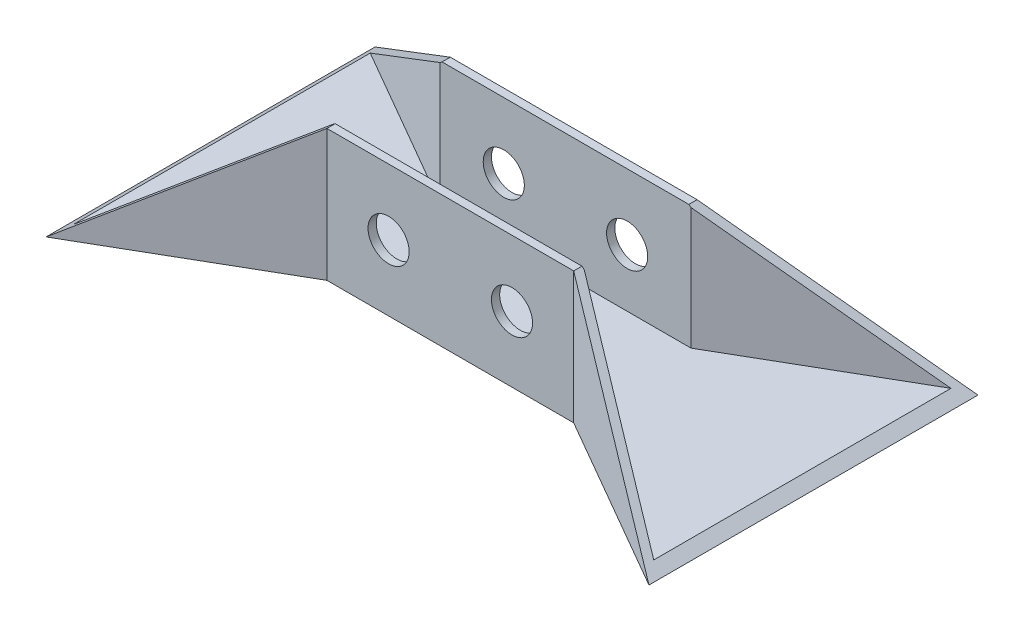
ISO-10303-21;
HEADER;
FILE_DESCRIPTION(('STEP AP214'),'2;1');
FILE_NAME('part.step','',(''),(''),'','','');
FILE_SCHEMA(('AUTOMOTIVE_DESIGN { 1 0 10303 214 1 1 1 1 }'));
ENDSEC;
DATA;
#1=APPLICATION_CONTEXT('core data for automotive mechanical design processes');
#2=APPLICATION_PROTOCOL_DEFINITION('international standard','automotive_design',2000,#1);
#3=PRODUCT_CONTEXT('',#1,'mechanical');
#4=PRODUCT('Part','Part','',(#3));
#5=PRODUCT_RELATED_PRODUCT_CATEGORY('part','',(#4));
#6=PRODUCT_DEFINITION_FORMATION('','',#4);
#7=PRODUCT_DEFINITION_CONTEXT('part definition',#1,'design');
#8=PRODUCT_DEFINITION('design','',#6,#7);
#9=PRODUCT_DEFINITION_SHAPE('','',#8);
#10=(LENGTH_UNIT() NAMED_UNIT(*) SI_UNIT(.MILLI.,.METRE.));
#11=(NAMED_UNIT(*) PLANE_ANGLE_UNIT() SI_UNIT($,.RADIAN.));
#12=(NAMED_UNIT(*) SI_UNIT($,.STERADIAN.) SOLID_ANGLE_UNIT());
#13=UNCERTAINTY_MEASURE_WITH_UNIT(LENGTH_MEASURE(1.E-05),#10,'distance_accuracy_value','');
#14=(GEOMETRIC_REPRESENTATION_CONTEXT(3) GLOBAL_UNCERTAINTY_ASSIGNED_CONTEXT((#13)) GLOBAL_UNIT_ASSIGNED_CONTEXT((#10,
#11,#12)) REPRESENTATION_CONTEXT('',''));
#15=CARTESIAN_POINT('',(0.,0.,0.));
#16=DIRECTION('',(0.,0.,1.));
#17=DIRECTION('',(1.,0.,0.));
#18=AXIS2_PLACEMENT_3D('',#15,#16,#17);
#19=CARTESIAN_POINT('',(0.,5.,0.));
#20=DIRECTION('',(0.,1.,0.));
#21=DIRECTION('',(0.,0.,1.));
#22=AXIS2_PLACEMENT_3D('',#19,#20,#21);
#23=PLANE('',#22);
#24=DIRECTION('',(0.,0.,1.));
#25=VECTOR('',#24,1.);
#26=CARTESIAN_POINT('',(176.487352005989,5.,0.));
#27=LINE('',#26,#25);
#28=CARTESIAN_POINT('',(176.487352005989,5.,-90.3202473081037));
#29=VERTEX_POINT('',#28);
#30=CARTESIAN_POINT('',(176.487352005989,5.,90.3202473081037));
#31=VERTEX_POINT('',#30);
#32=EDGE_CURVE('E221',#29,#31,#27,.T.);
#33=ORIENTED_EDGE('',*,*,#32,.F.);
#34=DIRECTION('',(0.866025403784438,0.,-0.500000000000001));
#35=VECTOR('',#34,1.);
#36=CARTESIAN_POINT('',(76.3397459621556,5.,-32.5));
#37=LINE('',#36,#35);
#38=CARTESIAN_POINT('',(76.3397459621556,5.,-32.5));
#39=VERTEX_POINT('',#38);
#40=EDGE_CURVE('E253',#39,#29,#37,.T.);
#41=ORIENTED_EDGE('',*,*,#40,.F.);
#42=DIRECTION('',(1.,0.,0.));
#43=VECTOR('',#42,1.);
#44=CARTESIAN_POINT('',(-76.3397459621556,5.,-32.5));
#45=LINE('',#44,#43);
#46=CARTESIAN_POINT('',(-76.3397459621556,5.,-32.5));
#47=VERTEX_POINT('',#46);
#48=EDGE_CURVE('E258',#47,#39,#45,.T.);
#49=ORIENTED_EDGE('',*,*,#48,.F.);
#50=DIRECTION('',(0.866025403784438,0.,0.500000000000001));
#51=VECTOR('',#50,1.);
#52=CARTESIAN_POINT('',(-183.253175473055,5.,-94.2264973081037));
#53=LINE('',#52,#51);
#54=CARTESIAN_POINT('',(-176.487352005989,5.,-90.3202473081037));
#55=VERTEX_POINT('',#54);
#56=EDGE_CURVE('E60',#55,#47,#53,.T.);
#57=ORIENTED_EDGE('',*,*,#56,.F.);
#58=DIRECTION('',(0.,0.,-1.));
#59=VECTOR('',#58,1.);
#60=CARTESIAN_POINT('',(-176.487352005989,5.,0.));
#61=LINE('',#60,#59);
#62=CARTESIAN_POINT('',(-176.487352005989,5.,90.3202473081038));
#63=VERTEX_POINT('',#62);
#64=EDGE_CURVE('E235',#63,#55,#61,.T.);
#65=ORIENTED_EDGE('',*,*,#64,.F.);
#66=DIRECTION('',(-0.866025403784438,0.,0.500000000000001));
#67=VECTOR('',#66,1.);
#68=CARTESIAN_POINT('',(-183.253175473055,5.,94.2264973081038));
#69=LINE('',#68,#67);
#70=CARTESIAN_POINT('',(-76.3397459621556,5.,32.5));
#71=VERTEX_POINT('',#70);
#72=EDGE_CURVE('E183',#71,#63,#69,.T.);
#73=ORIENTED_EDGE('',*,*,#72,.F.);
#74=DIRECTION('',(-1.,0.,0.));
#75=VECTOR('',#74,1.);
#76=CARTESIAN_POINT('',(-76.3397459621556,5.,32.5));
#77=LINE('',#76,#75);
#78=CARTESIAN_POINT('',(76.3397459621556,5.,32.5));
#79=VERTEX_POINT('',#78);
#80=EDGE_CURVE('E188',#79,#71,#77,.T.);
#81=ORIENTED_EDGE('',*,*,#80,.F.);
#82=DIRECTION('',(-0.866025403784438,0.,-0.500000000000001));
#83=VECTOR('',#82,1.);
#84=CARTESIAN_POINT('',(76.3397459621556,5.,32.5));
#85=LINE('',#84,#83);
#86=EDGE_CURVE('E187',#31,#79,#85,.T.);
#87=ORIENTED_EDGE('',*,*,#86,.F.);
#88=EDGE_LOOP('',(#33,#41,#49,#57,#65,#73,#81,#87));
#89=FACE_BOUND('',#88,.T.);
#90=ADVANCED_FACE('F35',(#89),#23,.T.);
#91=CARTESIAN_POINT('',(-75.,5.,-37.5));
#92=DIRECTION('',(-0.500000000000001,0.,0.866025403784438));
#93=DIRECTION('',(0.866025403784438,0.,0.500000000000001));
#94=AXIS2_PLACEMENT_3D('',#91,#92,#93);
#95=PLANE('',#94);
#96=DIRECTION('',(-0.866025403784438,0.,-0.500000000000001));
#97=VECTOR('',#96,1.);
#98=CARTESIAN_POINT('',(-75.,0.,-37.5));
#99=LINE('',#98,#97);
#100=CARTESIAN_POINT('',(-75.,0.,-37.5));
#101=VERTEX_POINT('',#100);
#102=CARTESIAN_POINT('',(-183.253175473055,0.,-100.));
#103=VERTEX_POINT('',#102);
#104=EDGE_CURVE('E278',#101,#103,#99,.T.);
#105=ORIENTED_EDGE('',*,*,#104,.T.);
#106=DIRECTION('',(0.729428429853969,0.539053696423368,0.421135700330756));
#107=VECTOR('',#106,1.);
#108=CARTESIAN_POINT('',(-104.490081854181,58.2065834279228,-54.5261066969353));
#109=LINE('',#108,#107);
#110=CARTESIAN_POINT('',(-75.,80.,-37.5));
#111=VERTEX_POINT('',#110);
#112=EDGE_CURVE('E246',#103,#111,#109,.T.);
#113=ORIENTED_EDGE('',*,*,#112,.T.);
#114=DIRECTION('',(0.,-1.,0.));
#115=VECTOR('',#114,1.);
#116=CARTESIAN_POINT('',(-75.,5.,-37.5));
#117=LINE('',#116,#115);
#118=EDGE_CURVE('E171',#111,#101,#117,.T.);
#119=ORIENTED_EDGE('',*,*,#118,.T.);
#120=EDGE_LOOP('',(#105,#113,#119));
#121=FACE_BOUND('',#120,.T.);
#122=ADVANCED_FACE('F37',(#121),#95,.F.);
#123=CARTESIAN_POINT('',(-183.253175473055,5.,100.));
#124=DIRECTION('',(-0.500000000000001,0.,-0.866025403784438));
#125=DIRECTION('',(-0.866025403784438,0.,0.500000000000001));
#126=AXIS2_PLACEMENT_3D('',#123,#124,#125);
#127=PLANE('',#126);
#128=DIRECTION('',(0.,-1.,0.));
#129=VECTOR('',#128,1.);
#130=CARTESIAN_POINT('',(-75.,5.,37.5));
#131=LINE('',#130,#129);
#132=CARTESIAN_POINT('',(-75.,80.,37.5));
#133=VERTEX_POINT('',#132);
#134=CARTESIAN_POINT('',(-75.,0.,37.5));
#135=VERTEX_POINT('',#134);
#136=EDGE_CURVE('E178',#133,#135,#131,.T.);
#137=ORIENTED_EDGE('',*,*,#136,.F.);
#138=DIRECTION('',(-0.729428429853969,-0.539053696423368,0.421135700330756));
#139=VECTOR('',#138,1.);
#140=CARTESIAN_POINT('',(-181.287170016109,1.45289443813848,98.8649262202043));
#141=LINE('',#140,#139);
#142=CARTESIAN_POINT('',(-183.253175473055,0.,100.));
#143=VERTEX_POINT('',#142);
#144=EDGE_CURVE('E243',#133,#143,#141,.T.);
#145=ORIENTED_EDGE('',*,*,#144,.T.);
#146=DIRECTION('',(0.866025403784438,0.,-0.500000000000001));
#147=VECTOR('',#146,1.);
#148=CARTESIAN_POINT('',(-183.253175473055,0.,100.));
#149=LINE('',#148,#147);
#150=EDGE_CURVE('E283',#143,#135,#149,.T.);
#151=ORIENTED_EDGE('',*,*,#150,.T.);
#152=EDGE_LOOP('',(#137,#145,#151));
#153=FACE_BOUND('',#152,.T.);
#154=ADVANCED_FACE('F291',(#153),#127,.F.);
#155=CARTESIAN_POINT('',(-75.,5.,37.5));
#156=DIRECTION('',(0.,0.,-1.));
#157=DIRECTION('',(-1.,0.,0.));
#158=AXIS2_PLACEMENT_3D('',#155,#156,#157);
#159=PLANE('',#158);
#160=CARTESIAN_POINT('',(37.5,40.,37.5));
#161=DIRECTION('',(0.,0.,-1.));
#162=DIRECTION('',(-1.,0.,0.));
#163=AXIS2_PLACEMENT_3D('',#160,#161,#162);
#164=CIRCLE('',#163,12.5);
#165=CARTESIAN_POINT('',(25.,40.,37.5));
#166=VERTEX_POINT('',#165);
#167=EDGE_CURVE('E193',#166,#166,#164,.T.);
#168=ORIENTED_EDGE('',*,*,#167,.T.);
#169=EDGE_LOOP('',(#168));
#170=FACE_BOUND('',#169,.T.);
#171=CARTESIAN_POINT('',(-37.5,40.,37.5));
#172=DIRECTION('',(0.,0.,-1.));
#173=DIRECTION('',(-1.,0.,0.));
#174=AXIS2_PLACEMENT_3D('',#171,#172,#173);
#175=CIRCLE('',#174,12.5);
#176=CARTESIAN_POINT('',(-50.,40.,37.5));
#177=VERTEX_POINT('',#176);
#178=EDGE_CURVE('E211',#177,#177,#175,.T.);
#179=ORIENTED_EDGE('',*,*,#178,.T.);
#180=EDGE_LOOP('',(#179));
#181=FACE_BOUND('',#180,.T.);
#182=DIRECTION('',(1.,0.,0.));
#183=VECTOR('',#182,1.);
#184=CARTESIAN_POINT('',(-75.,0.,37.5));
#185=LINE('',#184,#183);
#186=CARTESIAN_POINT('',(75.,0.,37.5));
#187=VERTEX_POINT('',#186);
#188=EDGE_CURVE('E158',#135,#187,#185,.T.);
#189=ORIENTED_EDGE('',*,*,#188,.T.);
#190=DIRECTION('',(0.,-1.,0.));
#191=VECTOR('',#190,1.);
#192=CARTESIAN_POINT('',(75.,5.,37.5));
#193=LINE('',#192,#191);
#194=CARTESIAN_POINT('',(75.,80.,37.5));
#195=VERTEX_POINT('',#194);
#196=EDGE_CURVE('E155',#195,#187,#193,.T.);
#197=ORIENTED_EDGE('',*,*,#196,.F.);
#198=DIRECTION('',(1.,0.,0.));
#199=VECTOR('',#198,1.);
#200=CARTESIAN_POINT('',(-75.,80.,37.5));
#201=LINE('',#200,#199);
#202=EDGE_CURVE('E265',#133,#195,#201,.T.);
#203=ORIENTED_EDGE('',*,*,#202,.F.);
#204=ORIENTED_EDGE('',*,*,#136,.T.);
#205=EDGE_LOOP('',(#189,#197,#203,#204));
#206=FACE_BOUND('',#205,.T.);
#207=ADVANCED_FACE('F285',(#170,#181,#206),#159,.F.);
#208=CARTESIAN_POINT('',(75.,5.,37.5));
#209=DIRECTION('',(0.500000000000001,0.,-0.866025403784438));
#210=DIRECTION('',(-0.866025403784438,0.,-0.500000000000001));
#211=AXIS2_PLACEMENT_3D('',#208,#209,#210);
#212=PLANE('',#211);
#213=DIRECTION('',(0.866025403784438,0.,0.500000000000001));
#214=VECTOR('',#213,1.);
#215=CARTESIAN_POINT('',(75.,0.,37.5));
#216=LINE('',#215,#214);
#217=CARTESIAN_POINT('',(183.253175473055,0.,100.));
#218=VERTEX_POINT('',#217);
#219=EDGE_CURVE('E153',#187,#218,#216,.T.);
#220=ORIENTED_EDGE('',*,*,#219,.T.);
#221=DIRECTION('',(-0.729428429853969,0.539053696423368,-0.421135700330756));
#222=VECTOR('',#221,1.);
#223=CARTESIAN_POINT('',(104.490081854181,58.2065834279228,54.5261066969353));
#224=LINE('',#223,#222);
#225=EDGE_CURVE('E138',#218,#195,#224,.T.);
#226=ORIENTED_EDGE('',*,*,#225,.T.);
#227=ORIENTED_EDGE('',*,*,#196,.T.);
#228=EDGE_LOOP('',(#220,#226,#227));
#229=FACE_BOUND('',#228,.T.);
#230=ADVANCED_FACE('F154',(#229),#212,.F.);
#231=CARTESIAN_POINT('',(183.253175473055,5.,-100.));
#232=DIRECTION('',(0.500000000000001,0.,0.866025403784438));
#233=DIRECTION('',(0.866025403784438,0.,-0.500000000000001));
#234=AXIS2_PLACEMENT_3D('',#231,#232,#233);
#235=PLANE('',#234);
#236=DIRECTION('',(0.,-1.,0.));
#237=VECTOR('',#236,1.);
#238=CARTESIAN_POINT('',(75.,5.,-37.5));
#239=LINE('',#238,#237);
#240=CARTESIAN_POINT('',(75.,80.,-37.5));
#241=VERTEX_POINT('',#240);
#242=CARTESIAN_POINT('',(75.,0.,-37.5));
#243=VERTEX_POINT('',#242);
#244=EDGE_CURVE('E174',#241,#243,#239,.T.);
#245=ORIENTED_EDGE('',*,*,#244,.F.);
#246=DIRECTION('',(0.729428429853969,-0.539053696423368,-0.421135700330756));
#247=VECTOR('',#246,1.);
#248=CARTESIAN_POINT('',(181.287170016109,1.45289443813848,-98.8649262202043));
#249=LINE('',#248,#247);
#250=CARTESIAN_POINT('',(183.253175473055,0.,-100.));
#251=VERTEX_POINT('',#250);
#252=EDGE_CURVE('E150',#241,#251,#249,.T.);
#253=ORIENTED_EDGE('',*,*,#252,.T.);
#254=DIRECTION('',(-0.866025403784438,0.,0.500000000000001));
#255=VECTOR('',#254,1.);
#256=CARTESIAN_POINT('',(183.253175473055,0.,-100.));
#257=LINE('',#256,#255);
#258=EDGE_CURVE('E164',#251,#243,#257,.T.);
#259=ORIENTED_EDGE('',*,*,#258,.T.);
#260=EDGE_LOOP('',(#245,#253,#259));
#261=FACE_BOUND('',#260,.T.);
#262=ADVANCED_FACE('F344',(#261),#235,.F.);
#263=CARTESIAN_POINT('',(75.,5.,-37.5));
#264=DIRECTION('',(0.,0.,1.));
#265=DIRECTION('',(1.,0.,0.));
#266=AXIS2_PLACEMENT_3D('',#263,#264,#265);
#267=PLANE('',#266);
#268=CARTESIAN_POINT('',(37.5,40.,-37.5));
#269=DIRECTION('',(0.,0.,1.));
#270=DIRECTION('',(1.,0.,0.));
#271=AXIS2_PLACEMENT_3D('',#268,#269,#270);
#272=CIRCLE('',#271,12.5);
#273=CARTESIAN_POINT('',(50.,40.,-37.5));
#274=VERTEX_POINT('',#273);
#275=EDGE_CURVE('E200',#274,#274,#272,.T.);
#276=ORIENTED_EDGE('',*,*,#275,.T.);
#277=EDGE_LOOP('',(#276));
#278=FACE_BOUND('',#277,.T.);
#279=CARTESIAN_POINT('',(-37.5,40.,-37.5));
#280=DIRECTION('',(0.,0.,1.));
#281=DIRECTION('',(1.,0.,0.));
#282=AXIS2_PLACEMENT_3D('',#279,#280,#281);
#283=CIRCLE('',#282,12.5);
#284=CARTESIAN_POINT('',(-25.,40.,-37.5));
#285=VERTEX_POINT('',#284);
#286=EDGE_CURVE('E197',#285,#285,#283,.T.);
#287=ORIENTED_EDGE('',*,*,#286,.T.);
#288=EDGE_LOOP('',(#287));
#289=FACE_BOUND('',#288,.T.);
#290=DIRECTION('',(-1.,0.,0.));
#291=VECTOR('',#290,1.);
#292=CARTESIAN_POINT('',(75.,0.,-37.5));
#293=LINE('',#292,#291);
#294=EDGE_CURVE('E166',#243,#101,#293,.T.);
#295=ORIENTED_EDGE('',*,*,#294,.T.);
#296=ORIENTED_EDGE('',*,*,#118,.F.);
#297=DIRECTION('',(-1.,0.,0.));
#298=VECTOR('',#297,1.);
#299=CARTESIAN_POINT('',(-75.,80.,-37.5));
#300=LINE('',#299,#298);
#301=EDGE_CURVE('E252',#241,#111,#300,.T.);
#302=ORIENTED_EDGE('',*,*,#301,.F.);
#303=ORIENTED_EDGE('',*,*,#244,.T.);
#304=EDGE_LOOP('',(#295,#296,#302,#303));
#305=FACE_BOUND('',#304,.T.);
#306=ADVANCED_FACE('F341',(#278,#289,#305),#267,.F.);
#307=CARTESIAN_POINT('',(0.,0.,0.));
#308=DIRECTION('',(0.,1.,0.));
#309=DIRECTION('',(0.,0.,1.));
#310=AXIS2_PLACEMENT_3D('',#307,#308,#309);
#311=PLANE('',#310);
#312=ORIENTED_EDGE('',*,*,#104,.F.);
#313=ORIENTED_EDGE('',*,*,#294,.F.);
#314=ORIENTED_EDGE('',*,*,#258,.F.);
#315=DIRECTION('',(0.,0.,-1.));
#316=VECTOR('',#315,1.);
#317=CARTESIAN_POINT('',(183.253175473055,0.,100.));
#318=LINE('',#317,#316);
#319=EDGE_CURVE('E142',#218,#251,#318,.T.);
#320=ORIENTED_EDGE('',*,*,#319,.F.);
#321=ORIENTED_EDGE('',*,*,#219,.F.);
#322=ORIENTED_EDGE('',*,*,#188,.F.);
#323=ORIENTED_EDGE('',*,*,#150,.F.);
#324=DIRECTION('',(0.,0.,1.));
#325=VECTOR('',#324,1.);
#326=CARTESIAN_POINT('',(-183.253175473055,0.,-100.));
#327=LINE('',#326,#325);
#328=EDGE_CURVE('E281',#103,#143,#327,.T.);
#329=ORIENTED_EDGE('',*,*,#328,.F.);
#330=EDGE_LOOP('',(#312,#313,#314,#320,#321,#322,#323,#329));
#331=FACE_BOUND('',#330,.T.);
#332=ADVANCED_FACE('F162',(#331),#311,.F.);
#333=CARTESIAN_POINT('',(76.3397459621556,80.,32.5));
#334=DIRECTION('',(-0.500000000000001,0.,0.866025403784438));
#335=DIRECTION('',(0.866025403784438,0.,0.500000000000001));
#336=AXIS2_PLACEMENT_3D('',#333,#334,#335);
#337=PLANE('',#336);
#338=DIRECTION('',(0.,-1.,0.));
#339=VECTOR('',#338,1.);
#340=CARTESIAN_POINT('',(76.3397459621556,80.,32.5));
#341=LINE('',#340,#339);
#342=CARTESIAN_POINT('',(76.3397459621556,79.0099165543728,32.5));
#343=VERTEX_POINT('',#342);
#344=EDGE_CURVE('E275',#343,#79,#341,.T.);
#345=ORIENTED_EDGE('',*,*,#344,.F.);
#346=DIRECTION('',(0.729428429853969,-0.539053696423368,0.421135700330756));
#347=VECTOR('',#346,1.);
#348=CARTESIAN_POINT('',(75.9504440707687,79.2976139006617,32.2752364482117));
#349=LINE('',#348,#347);
#350=EDGE_CURVE('E223',#343,#31,#349,.T.);
#351=ORIENTED_EDGE('',*,*,#350,.T.);
#352=ORIENTED_EDGE('',*,*,#86,.T.);
#353=EDGE_LOOP('',(#345,#351,#352));
#354=FACE_BOUND('',#353,.T.);
#355=ADVANCED_FACE('F311',(#354),#337,.F.);
#356=CARTESIAN_POINT('',(-76.3397459621556,80.,32.5));
#357=DIRECTION('',(0.,0.,1.));
#358=DIRECTION('',(1.,0.,0.));
#359=AXIS2_PLACEMENT_3D('',#356,#357,#358);
#360=PLANE('',#359);
#361=CARTESIAN_POINT('',(37.5,40.,32.5));
#362=DIRECTION('',(0.,0.,1.));
#363=DIRECTION('',(1.,0.,0.));
#364=AXIS2_PLACEMENT_3D('',#361,#362,#363);
#365=CIRCLE('',#364,12.5);
#366=CARTESIAN_POINT('',(50.,40.,32.5));
#367=VERTEX_POINT('',#366);
#368=EDGE_CURVE('E205',#367,#367,#365,.T.);
#369=ORIENTED_EDGE('',*,*,#368,.T.);
#370=EDGE_LOOP('',(#369));
#371=FACE_BOUND('',#370,.T.);
#372=CARTESIAN_POINT('',(-37.5,40.,32.5));
#373=DIRECTION('',(0.,0.,1.));
#374=DIRECTION('',(1.,0.,0.));
#375=AXIS2_PLACEMENT_3D('',#372,#373,#374);
#376=CIRCLE('',#375,12.5);
#377=CARTESIAN_POINT('',(-25.,40.,32.5));
#378=VERTEX_POINT('',#377);
#379=EDGE_CURVE('E192',#378,#378,#376,.T.);
#380=ORIENTED_EDGE('',*,*,#379,.T.);
#381=EDGE_LOOP('',(#380));
#382=FACE_BOUND('',#381,.T.);
#383=DIRECTION('',(-1.,0.,0.));
#384=VECTOR('',#383,1.);
#385=CARTESIAN_POINT('',(-76.3397459621556,80.,32.5));
#386=LINE('',#385,#384);
#387=CARTESIAN_POINT('',(75.,80.,32.5));
#388=VERTEX_POINT('',#387);
#389=CARTESIAN_POINT('',(-75.,80.,32.5));
#390=VERTEX_POINT('',#389);
#391=EDGE_CURVE('E268',#388,#390,#386,.T.);
#392=ORIENTED_EDGE('',*,*,#391,.F.);
#393=DIRECTION('',(0.804223072234167,-0.594327561270919,0.));
#394=VECTOR('',#393,1.);
#395=CARTESIAN_POINT('',(-22.8827263466855,152.33615155875,32.5));
#396=LINE('',#395,#394);
#397=EDGE_CURVE('E226',#388,#343,#396,.T.);
#398=ORIENTED_EDGE('',*,*,#397,.T.);
#399=ORIENTED_EDGE('',*,*,#344,.T.);
#400=ORIENTED_EDGE('',*,*,#80,.T.);
#401=DIRECTION('',(0.,-1.,0.));
#402=VECTOR('',#401,1.);
#403=CARTESIAN_POINT('',(-76.3397459621556,80.,32.5));
#404=LINE('',#403,#402);
#405=CARTESIAN_POINT('',(-76.3397459621556,79.0099165543728,32.5));
#406=VERTEX_POINT('',#405);
#407=EDGE_CURVE('E270',#406,#71,#404,.T.);
#408=ORIENTED_EDGE('',*,*,#407,.F.);
#409=DIRECTION('',(0.804223072234167,0.594327561270919,0.));
#410=VECTOR('',#409,1.);
#411=CARTESIAN_POINT('',(-75.8665138596212,79.3596390270607,32.5));
#412=LINE('',#411,#410);
#413=EDGE_CURVE('E240',#406,#390,#412,.T.);
#414=ORIENTED_EDGE('',*,*,#413,.T.);
#415=EDGE_LOOP('',(#392,#398,#399,#400,#408,#414));
#416=FACE_BOUND('',#415,.T.);
#417=ADVANCED_FACE('F298',(#371,#382,#416),#360,.F.);
#418=CARTESIAN_POINT('',(-183.253175473055,80.,94.2264973081038));
#419=DIRECTION('',(0.500000000000001,0.,0.866025403784438));
#420=DIRECTION('',(0.866025403784438,0.,-0.500000000000001));
#421=AXIS2_PLACEMENT_3D('',#418,#419,#420);
#422=PLANE('',#421);
#423=ORIENTED_EDGE('',*,*,#72,.T.);
#424=DIRECTION('',(0.729428429853969,0.539053696423368,-0.421135700330756));
#425=VECTOR('',#424,1.);
#426=CARTESIAN_POINT('',(-151.797088161929,23.2463110102157,76.0653168313727));
#427=LINE('',#426,#425);
#428=EDGE_CURVE('E237',#63,#406,#427,.T.);
#429=ORIENTED_EDGE('',*,*,#428,.T.);
#430=ORIENTED_EDGE('',*,*,#407,.T.);
#431=EDGE_LOOP('',(#423,#429,#430));
#432=FACE_BOUND('',#431,.T.);
#433=ADVANCED_FACE('F304',(#432),#422,.F.);
#434=CARTESIAN_POINT('',(0.,80.,0.));
#435=DIRECTION('',(0.,-1.,0.));
#436=DIRECTION('',(0.,0.,-1.));
#437=AXIS2_PLACEMENT_3D('',#434,#435,#436);
#438=PLANE('',#437);
#439=ORIENTED_EDGE('',*,*,#202,.T.);
#440=DIRECTION('',(0.,0.,1.));
#441=VECTOR('',#440,1.);
#442=CARTESIAN_POINT('',(75.,80.,-100.));
#443=LINE('',#442,#441);
#444=EDGE_CURVE('E145',#388,#195,#443,.T.);
#445=ORIENTED_EDGE('',*,*,#444,.F.);
#446=ORIENTED_EDGE('',*,*,#391,.T.);
#447=DIRECTION('',(0.,0.,1.));
#448=VECTOR('',#447,1.);
#449=CARTESIAN_POINT('',(-75.,80.,-100.));
#450=LINE('',#449,#448);
#451=EDGE_CURVE('E149',#390,#133,#450,.T.);
#452=ORIENTED_EDGE('',*,*,#451,.T.);
#453=EDGE_LOOP('',(#439,#445,#446,#452));
#454=FACE_BOUND('',#453,.T.);
#455=ADVANCED_FACE('F295',(#454),#438,.F.);
#456=CARTESIAN_POINT('',(-183.253175473055,80.,-94.2264973081037));
#457=DIRECTION('',(0.500000000000001,0.,-0.866025403784438));
#458=DIRECTION('',(-0.866025403784438,0.,-0.500000000000001));
#459=AXIS2_PLACEMENT_3D('',#456,#457,#458);
#460=PLANE('',#459);
#461=DIRECTION('',(0.,-1.,0.));
#462=VECTOR('',#461,1.);
#463=CARTESIAN_POINT('',(-76.3397459621556,80.,-32.5));
#464=LINE('',#463,#462);
#465=CARTESIAN_POINT('',(-76.3397459621556,79.0099165543728,-32.5));
#466=VERTEX_POINT('',#465);
#467=EDGE_CURVE('E189',#466,#47,#464,.T.);
#468=ORIENTED_EDGE('',*,*,#467,.F.);
#469=DIRECTION('',(-0.729428429853969,-0.539053696423368,-0.421135700330756));
#470=VECTOR('',#469,1.);
#471=CARTESIAN_POINT('',(-151.797088161929,23.2463110102157,-76.0653168313727));
#472=LINE('',#471,#470);
#473=EDGE_CURVE('E233',#466,#55,#472,.T.);
#474=ORIENTED_EDGE('',*,*,#473,.T.);
#475=ORIENTED_EDGE('',*,*,#56,.T.);
#476=EDGE_LOOP('',(#468,#474,#475));
#477=FACE_BOUND('',#476,.T.);
#478=ADVANCED_FACE('F320',(#477),#460,.F.);
#479=CARTESIAN_POINT('',(-76.3397459621556,80.,-32.5));
#480=DIRECTION('',(0.,0.,-1.));
#481=DIRECTION('',(-1.,0.,0.));
#482=AXIS2_PLACEMENT_3D('',#479,#480,#481);
#483=PLANE('',#482);
#484=CARTESIAN_POINT('',(37.5,40.,-32.5));
#485=DIRECTION('',(0.,0.,-1.));
#486=DIRECTION('',(-1.,0.,0.));
#487=AXIS2_PLACEMENT_3D('',#484,#485,#486);
#488=CIRCLE('',#487,12.5);
#489=CARTESIAN_POINT('',(25.,40.,-32.5));
#490=VERTEX_POINT('',#489);
#491=EDGE_CURVE('E39',#490,#490,#488,.T.);
#492=ORIENTED_EDGE('',*,*,#491,.T.);
#493=EDGE_LOOP('',(#492));
#494=FACE_BOUND('',#493,.T.);
#495=CARTESIAN_POINT('',(-37.5,40.,-32.5));
#496=DIRECTION('',(0.,0.,-1.));
#497=DIRECTION('',(-1.,0.,0.));
#498=AXIS2_PLACEMENT_3D('',#495,#496,#497);
#499=CIRCLE('',#498,12.5);
#500=CARTESIAN_POINT('',(-50.,40.,-32.5));
#501=VERTEX_POINT('',#500);
#502=EDGE_CURVE('E190',#501,#501,#499,.T.);
#503=ORIENTED_EDGE('',*,*,#502,.T.);
#504=EDGE_LOOP('',(#503));
#505=FACE_BOUND('',#504,.T.);
#506=DIRECTION('',(0.,-1.,0.));
#507=VECTOR('',#506,1.);
#508=CARTESIAN_POINT('',(76.3397459621556,80.,-32.5));
#509=LINE('',#508,#507);
#510=CARTESIAN_POINT('',(76.3397459621556,79.0099165543728,-32.5));
#511=VERTEX_POINT('',#510);
#512=EDGE_CURVE('E256',#511,#39,#509,.T.);
#513=ORIENTED_EDGE('',*,*,#512,.F.);
#514=DIRECTION('',(-0.804223072234167,0.594327561270919,0.));
#515=VECTOR('',#514,1.);
#516=CARTESIAN_POINT('',(-22.8827263466855,152.33615155875,-32.5));
#517=LINE('',#516,#515);
#518=CARTESIAN_POINT('',(75.,80.,-32.5));
#519=VERTEX_POINT('',#518);
#520=EDGE_CURVE('E218',#511,#519,#517,.T.);
#521=ORIENTED_EDGE('',*,*,#520,.T.);
#522=DIRECTION('',(1.,0.,0.));
#523=VECTOR('',#522,1.);
#524=CARTESIAN_POINT('',(-76.3397459621556,80.,-32.5));
#525=LINE('',#524,#523);
#526=CARTESIAN_POINT('',(-75.,80.,-32.5));
#527=VERTEX_POINT('',#526);
#528=EDGE_CURVE('E249',#527,#519,#525,.T.);
#529=ORIENTED_EDGE('',*,*,#528,.F.);
#530=DIRECTION('',(-0.804223072234167,-0.594327561270919,0.));
#531=VECTOR('',#530,1.);
#532=CARTESIAN_POINT('',(-75.8665138596212,79.3596390270607,-32.5));
#533=LINE('',#532,#531);
#534=EDGE_CURVE('E52',#527,#466,#533,.T.);
#535=ORIENTED_EDGE('',*,*,#534,.T.);
#536=ORIENTED_EDGE('',*,*,#467,.T.);
#537=ORIENTED_EDGE('',*,*,#48,.T.);
#538=EDGE_LOOP('',(#513,#521,#529,#535,#536,#537));
#539=FACE_BOUND('',#538,.T.);
#540=ADVANCED_FACE('F318',(#494,#505,#539),#483,.F.);
#541=CARTESIAN_POINT('',(76.3397459621556,80.,-32.5));
#542=DIRECTION('',(-0.500000000000001,0.,-0.866025403784438));
#543=DIRECTION('',(-0.866025403784438,0.,0.500000000000001));
#544=AXIS2_PLACEMENT_3D('',#541,#542,#543);
#545=PLANE('',#544);
#546=ORIENTED_EDGE('',*,*,#40,.T.);
#547=DIRECTION('',(-0.729428429853969,0.539053696423368,0.421135700330756));
#548=VECTOR('',#547,1.);
#549=CARTESIAN_POINT('',(75.9504440707687,79.2976139006617,-32.2752364482117));
#550=LINE('',#549,#548);
#551=EDGE_CURVE('E215',#29,#511,#550,.T.);
#552=ORIENTED_EDGE('',*,*,#551,.T.);
#553=ORIENTED_EDGE('',*,*,#512,.T.);
#554=EDGE_LOOP('',(#546,#552,#553));
#555=FACE_BOUND('',#554,.T.);
#556=ADVANCED_FACE('F315',(#555),#545,.F.);
#557=CARTESIAN_POINT('',(0.,80.,0.));
#558=DIRECTION('',(0.,1.,0.));
#559=DIRECTION('',(0.,0.,1.));
#560=AXIS2_PLACEMENT_3D('',#557,#558,#559);
#561=PLANE('',#560);
#562=DIRECTION('',(0.,0.,1.));
#563=VECTOR('',#562,1.);
#564=CARTESIAN_POINT('',(75.,80.,0.));
#565=LINE('',#564,#563);
#566=EDGE_CURVE('E11',#241,#519,#565,.T.);
#567=ORIENTED_EDGE('',*,*,#566,.F.);
#568=ORIENTED_EDGE('',*,*,#301,.T.);
#569=DIRECTION('',(0.,0.,-1.));
#570=VECTOR('',#569,1.);
#571=CARTESIAN_POINT('',(-75.,80.,0.));
#572=LINE('',#571,#570);
#573=EDGE_CURVE('E44',#527,#111,#572,.T.);
#574=ORIENTED_EDGE('',*,*,#573,.F.);
#575=ORIENTED_EDGE('',*,*,#528,.T.);
#576=EDGE_LOOP('',(#567,#568,#574,#575));
#577=FACE_BOUND('',#576,.T.);
#578=ADVANCED_FACE('F414',(#577),#561,.T.);
#579=CARTESIAN_POINT('',(-183.253175473055,0.,-100.));
#580=DIRECTION('',(0.594327561270919,-0.804223072234167,0.));
#581=DIRECTION('',(0.804223072234167,0.594327561270919,0.));
#582=AXIS2_PLACEMENT_3D('',#579,#580,#581);
#583=PLANE('',#582);
#584=ORIENTED_EDGE('',*,*,#328,.T.);
#585=ORIENTED_EDGE('',*,*,#144,.F.);
#586=ORIENTED_EDGE('',*,*,#451,.F.);
#587=ORIENTED_EDGE('',*,*,#413,.F.);
#588=ORIENTED_EDGE('',*,*,#428,.F.);
#589=ORIENTED_EDGE('',*,*,#64,.T.);
#590=ORIENTED_EDGE('',*,*,#473,.F.);
#591=ORIENTED_EDGE('',*,*,#534,.F.);
#592=ORIENTED_EDGE('',*,*,#573,.T.);
#593=ORIENTED_EDGE('',*,*,#112,.F.);
#594=EDGE_LOOP('',(#584,#585,#586,#587,#588,#589,#590,#591,#592,#593));
#595=FACE_BOUND('',#594,.T.);
#596=ADVANCED_FACE('F293',(#595),#583,.F.);
#597=CARTESIAN_POINT('',(183.253175473055,0.,-100.));
#598=DIRECTION('',(-0.594327561270919,-0.804223072234167,0.));
#599=DIRECTION('',(0.804223072234167,-0.594327561270919,0.));
#600=AXIS2_PLACEMENT_3D('',#597,#598,#599);
#601=PLANE('',#600);
#602=ORIENTED_EDGE('',*,*,#319,.T.);
#603=ORIENTED_EDGE('',*,*,#252,.F.);
#604=ORIENTED_EDGE('',*,*,#566,.T.);
#605=ORIENTED_EDGE('',*,*,#520,.F.);
#606=ORIENTED_EDGE('',*,*,#551,.F.);
#607=ORIENTED_EDGE('',*,*,#32,.T.);
#608=ORIENTED_EDGE('',*,*,#350,.F.);
#609=ORIENTED_EDGE('',*,*,#397,.F.);
#610=ORIENTED_EDGE('',*,*,#444,.T.);
#611=ORIENTED_EDGE('',*,*,#225,.F.);
#612=EDGE_LOOP('',(#602,#603,#604,#605,#606,#607,#608,#609,#610,#611));
#613=FACE_BOUND('',#612,.T.);
#614=ADVANCED_FACE('F140',(#613),#601,.F.);
#615=CARTESIAN_POINT('',(-37.5,40.,-100.));
#616=DIRECTION('',(0.,0.,1.));
#617=DIRECTION('',(1.,0.,0.));
#618=AXIS2_PLACEMENT_3D('',#615,#616,#617);
#619=CYLINDRICAL_SURFACE('',#618,12.5);
#620=ORIENTED_EDGE('',*,*,#502,.F.);
#621=EDGE_LOOP('',(#620));
#622=FACE_BOUND('',#621,.T.);
#623=ORIENTED_EDGE('',*,*,#286,.F.);
#624=EDGE_LOOP('',(#623));
#625=FACE_BOUND('',#624,.T.);
#626=ADVANCED_FACE('F438',(#622,#625),#619,.F.);
#627=ORIENTED_EDGE('',*,*,#379,.F.);
#628=EDGE_LOOP('',(#627));
#629=FACE_BOUND('',#628,.T.);
#630=ORIENTED_EDGE('',*,*,#178,.F.);
#631=EDGE_LOOP('',(#630));
#632=FACE_BOUND('',#631,.T.);
#633=ADVANCED_FACE('F448',(#629,#632),#619,.F.);
#634=CARTESIAN_POINT('',(37.5,40.,-100.));
#635=DIRECTION('',(0.,0.,1.));
#636=DIRECTION('',(1.,0.,0.));
#637=AXIS2_PLACEMENT_3D('',#634,#635,#636);
#638=CYLINDRICAL_SURFACE('',#637,12.5);
#639=ORIENTED_EDGE('',*,*,#491,.F.);
#640=EDGE_LOOP('',(#639));
#641=FACE_BOUND('',#640,.T.);
#642=ORIENTED_EDGE('',*,*,#275,.F.);
#643=EDGE_LOOP('',(#642));
#644=FACE_BOUND('',#643,.T.);
#645=ADVANCED_FACE('F455',(#641,#644),#638,.F.);
#646=ORIENTED_EDGE('',*,*,#368,.F.);
#647=EDGE_LOOP('',(#646));
#648=FACE_BOUND('',#647,.T.);
#649=ORIENTED_EDGE('',*,*,#167,.F.);
#650=EDGE_LOOP('',(#649));
#651=FACE_BOUND('',#650,.T.);
#652=ADVANCED_FACE('F462',(#648,#651),#638,.F.);
#653=CLOSED_SHELL('',(#90,#122,#154,#207,#230,#262,#306,#332,#355,#417,#433,#455,#478,#540,#556,
#578,#596,#614,#626,#633,#645,#652));
#654=MANIFOLD_SOLID_BREP('B2',#653);
#655=ADVANCED_BREP_SHAPE_REPRESENTATION('',(#18,#654),#14);
#656=SHAPE_DEFINITION_REPRESENTATION(#9,#655);
ENDSEC;
END-ISO-10303-21;
